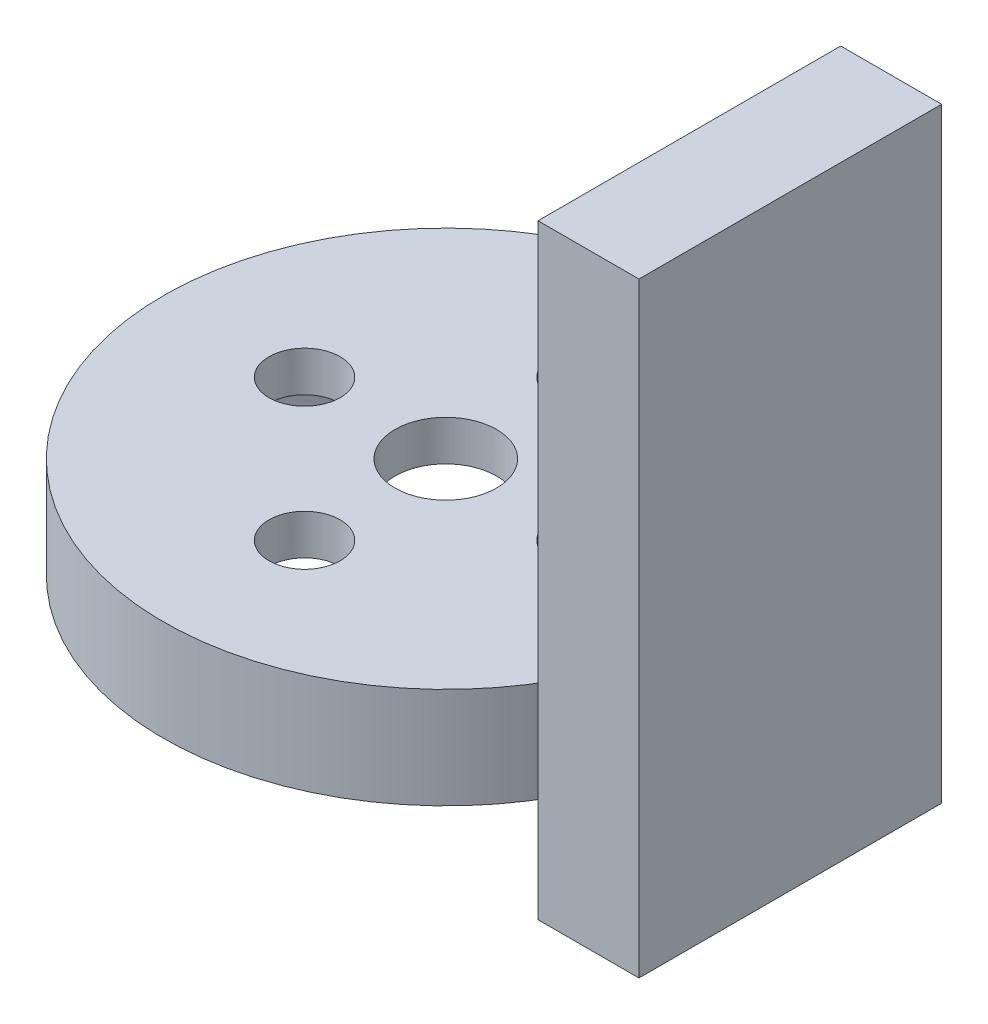
ISO-10303-21;
HEADER;
FILE_DESCRIPTION(('STEP AP214'),'2;1');
FILE_NAME('part.step','',(''),(''),'','','');
FILE_SCHEMA(('AUTOMOTIVE_DESIGN { 1 0 10303 214 1 1 1 1 }'));
ENDSEC;
DATA;
#1=APPLICATION_CONTEXT('core data for automotive mechanical design processes');
#2=APPLICATION_PROTOCOL_DEFINITION('international standard','automotive_design',2000,#1);
#3=PRODUCT_CONTEXT('',#1,'mechanical');
#4=PRODUCT('Part','Part','',(#3));
#5=PRODUCT_RELATED_PRODUCT_CATEGORY('part','',(#4));
#6=PRODUCT_DEFINITION_FORMATION('','',#4);
#7=PRODUCT_DEFINITION_CONTEXT('part definition',#1,'design');
#8=PRODUCT_DEFINITION('design','',#6,#7);
#9=PRODUCT_DEFINITION_SHAPE('','',#8);
#10=(LENGTH_UNIT() NAMED_UNIT(*) SI_UNIT(.MILLI.,.METRE.));
#11=(NAMED_UNIT(*) PLANE_ANGLE_UNIT() SI_UNIT($,.RADIAN.));
#12=(NAMED_UNIT(*) SI_UNIT($,.STERADIAN.) SOLID_ANGLE_UNIT());
#13=UNCERTAINTY_MEASURE_WITH_UNIT(LENGTH_MEASURE(1.E-05),#10,'distance_accuracy_value','');
#14=(GEOMETRIC_REPRESENTATION_CONTEXT(3) GLOBAL_UNCERTAINTY_ASSIGNED_CONTEXT((#13)) GLOBAL_UNIT_ASSIGNED_CONTEXT((#10,
#11,#12)) REPRESENTATION_CONTEXT('',''));
#15=CARTESIAN_POINT('',(0.,0.,0.));
#16=DIRECTION('',(0.,0.,1.));
#17=DIRECTION('',(1.,0.,0.));
#18=AXIS2_PLACEMENT_3D('',#15,#16,#17);
#19=CARTESIAN_POINT('',(0.,5.,0.));
#20=DIRECTION('',(0.,-1.,0.));
#21=DIRECTION('',(0.,0.,-1.));
#22=AXIS2_PLACEMENT_3D('',#19,#20,#21);
#23=CYLINDRICAL_SURFACE('',#22,2.51726059342607);
#24=CARTESIAN_POINT('',(0.,5.,0.));
#25=DIRECTION('',(0.,1.,0.));
#26=DIRECTION('',(0.,0.,1.));
#27=AXIS2_PLACEMENT_3D('',#24,#25,#26);
#28=CIRCLE('',#27,2.51726059342607);
#29=CARTESIAN_POINT('',(0.,5.,2.51726059342607));
#30=VERTEX_POINT('',#29);
#31=EDGE_CURVE('E166',#30,#30,#28,.T.);
#32=ORIENTED_EDGE('',*,*,#31,.T.);
#33=EDGE_LOOP('',(#32));
#34=FACE_BOUND('',#33,.T.);
#35=CARTESIAN_POINT('',(0.,3.,0.));
#36=DIRECTION('',(0.,-1.,0.));
#37=DIRECTION('',(0.,0.,-1.));
#38=AXIS2_PLACEMENT_3D('',#35,#36,#37);
#39=CIRCLE('',#38,2.51726059342607);
#40=CARTESIAN_POINT('',(0.,3.,-2.51726059342607));
#41=VERTEX_POINT('',#40);
#42=EDGE_CURVE('E132',#41,#41,#39,.T.);
#43=ORIENTED_EDGE('',*,*,#42,.T.);
#44=EDGE_LOOP('',(#43));
#45=FACE_BOUND('',#44,.T.);
#46=ADVANCED_FACE('F33',(#34,#45),#23,.F.);
#47=CARTESIAN_POINT('',(0.,5.,-7.));
#48=DIRECTION('',(0.,-1.,0.));
#49=DIRECTION('',(0.,0.,-1.));
#50=AXIS2_PLACEMENT_3D('',#47,#48,#49);
#51=CYLINDRICAL_SURFACE('',#50,1.76208241539825);
#52=CARTESIAN_POINT('',(0.,5.,-7.));
#53=DIRECTION('',(0.,1.,0.));
#54=DIRECTION('',(0.,0.,1.));
#55=AXIS2_PLACEMENT_3D('',#52,#53,#54);
#56=CIRCLE('',#55,1.76208241539825);
#57=CARTESIAN_POINT('',(0.,5.,-5.23791758460175));
#58=VERTEX_POINT('',#57);
#59=EDGE_CURVE('E163',#58,#58,#56,.T.);
#60=ORIENTED_EDGE('',*,*,#59,.T.);
#61=EDGE_LOOP('',(#60));
#62=FACE_BOUND('',#61,.T.);
#63=CARTESIAN_POINT('',(0.,3.,-7.));
#64=DIRECTION('',(0.,-1.,0.));
#65=DIRECTION('',(0.,0.,-1.));
#66=AXIS2_PLACEMENT_3D('',#63,#64,#65);
#67=CIRCLE('',#66,1.76208241539825);
#68=CARTESIAN_POINT('',(0.,3.,-8.76208241539825));
#69=VERTEX_POINT('',#68);
#70=EDGE_CURVE('E290',#69,#69,#67,.T.);
#71=ORIENTED_EDGE('',*,*,#70,.T.);
#72=EDGE_LOOP('',(#71));
#73=FACE_BOUND('',#72,.T.);
#74=ADVANCED_FACE('F228',(#62,#73),#51,.F.);
#75=CARTESIAN_POINT('',(7.0000000000002,5.,-1.98094713253425E-13));
#76=DIRECTION('',(0.,-1.,0.));
#77=DIRECTION('',(0.,0.,-1.));
#78=AXIS2_PLACEMENT_3D('',#75,#76,#77);
#79=CYLINDRICAL_SURFACE('',#78,1.7620824153984);
#80=CARTESIAN_POINT('',(7.0000000000002,5.,-1.98094713253425E-13));
#81=DIRECTION('',(0.,1.,0.));
#82=DIRECTION('',(0.,0.,1.));
#83=AXIS2_PLACEMENT_3D('',#80,#81,#82);
#84=CIRCLE('',#83,1.7620824153984);
#85=CARTESIAN_POINT('',(7.0000000000002,5.,1.7620824153982));
#86=VERTEX_POINT('',#85);
#87=EDGE_CURVE('E160',#86,#86,#84,.T.);
#88=ORIENTED_EDGE('',*,*,#87,.T.);
#89=EDGE_LOOP('',(#88));
#90=FACE_BOUND('',#89,.T.);
#91=CARTESIAN_POINT('',(7.0000000000002,3.,-1.98094713253425E-13));
#92=DIRECTION('',(0.,-1.,0.));
#93=DIRECTION('',(0.,0.,-1.));
#94=AXIS2_PLACEMENT_3D('',#91,#92,#93);
#95=CIRCLE('',#94,1.7620824153984);
#96=CARTESIAN_POINT('',(7.0000000000002,3.,-1.7620824153986));
#97=VERTEX_POINT('',#96);
#98=EDGE_CURVE('E288',#97,#97,#95,.T.);
#99=ORIENTED_EDGE('',*,*,#98,.T.);
#100=EDGE_LOOP('',(#99));
#101=FACE_BOUND('',#100,.T.);
#102=ADVANCED_FACE('F234',(#90,#101),#79,.F.);
#103=CARTESIAN_POINT('',(3.9618942650685E-13,5.,7.));
#104=DIRECTION('',(0.,-1.,0.));
#105=DIRECTION('',(0.,0.,-1.));
#106=AXIS2_PLACEMENT_3D('',#103,#104,#105);
#107=CYLINDRICAL_SURFACE('',#106,1.76208241539867);
#108=CARTESIAN_POINT('',(3.9618942650685E-13,5.,7.));
#109=DIRECTION('',(0.,1.,0.));
#110=DIRECTION('',(0.,0.,1.));
#111=AXIS2_PLACEMENT_3D('',#108,#109,#110);
#112=CIRCLE('',#111,1.76208241539867);
#113=CARTESIAN_POINT('',(3.9618942650685E-13,5.,8.76208241539867));
#114=VERTEX_POINT('',#113);
#115=EDGE_CURVE('E157',#114,#114,#112,.T.);
#116=ORIENTED_EDGE('',*,*,#115,.T.);
#117=EDGE_LOOP('',(#116));
#118=FACE_BOUND('',#117,.T.);
#119=CARTESIAN_POINT('',(3.9618942650685E-13,3.,7.));
#120=DIRECTION('',(0.,-1.,0.));
#121=DIRECTION('',(0.,0.,-1.));
#122=AXIS2_PLACEMENT_3D('',#119,#120,#121);
#123=CIRCLE('',#122,1.76208241539867);
#124=CARTESIAN_POINT('',(3.9618942650685E-13,3.,5.23791758460133));
#125=VERTEX_POINT('',#124);
#126=EDGE_CURVE('E178',#125,#125,#123,.T.);
#127=ORIENTED_EDGE('',*,*,#126,.T.);
#128=EDGE_LOOP('',(#127));
#129=FACE_BOUND('',#128,.T.);
#130=ADVANCED_FACE('F276',(#118,#129),#107,.F.);
#131=CARTESIAN_POINT('',(-6.9999999999998,5.,1.98951966012828E-13));
#132=DIRECTION('',(0.,-1.,0.));
#133=DIRECTION('',(0.,0.,-1.));
#134=AXIS2_PLACEMENT_3D('',#131,#132,#133);
#135=CYLINDRICAL_SURFACE('',#134,1.76208241539857);
#136=CARTESIAN_POINT('',(-6.9999999999998,5.,1.98951966012828E-13));
#137=DIRECTION('',(0.,1.,0.));
#138=DIRECTION('',(0.,0.,1.));
#139=AXIS2_PLACEMENT_3D('',#136,#137,#138);
#140=CIRCLE('',#139,1.76208241539857);
#141=CARTESIAN_POINT('',(-6.9999999999998,5.,1.76208241539876));
#142=VERTEX_POINT('',#141);
#143=EDGE_CURVE('E154',#142,#142,#140,.T.);
#144=ORIENTED_EDGE('',*,*,#143,.T.);
#145=EDGE_LOOP('',(#144));
#146=FACE_BOUND('',#145,.T.);
#147=CARTESIAN_POINT('',(-6.9999999999998,3.,1.98951966012828E-13));
#148=DIRECTION('',(0.,-1.,0.));
#149=DIRECTION('',(0.,0.,-1.));
#150=AXIS2_PLACEMENT_3D('',#147,#148,#149);
#151=CIRCLE('',#150,1.76208241539857);
#152=CARTESIAN_POINT('',(-6.9999999999998,3.,-1.76208241539837));
#153=VERTEX_POINT('',#152);
#154=EDGE_CURVE('E175',#153,#153,#151,.T.);
#155=ORIENTED_EDGE('',*,*,#154,.T.);
#156=EDGE_LOOP('',(#155));
#157=FACE_BOUND('',#156,.T.);
#158=ADVANCED_FACE('F242',(#146,#157),#135,.F.);
#159=CARTESIAN_POINT('',(0.,5.,0.));
#160=DIRECTION('',(0.,1.,0.));
#161=DIRECTION('',(0.,0.,1.));
#162=AXIS2_PLACEMENT_3D('',#159,#160,#161);
#163=PLANE('',#162);
#164=DIRECTION('',(0.,0.,1.));
#165=VECTOR('',#164,1.);
#166=CARTESIAN_POINT('',(17.0714946528496,5.,0.));
#167=LINE('',#166,#165);
#168=CARTESIAN_POINT('',(17.0714946528496,5.,-2.5));
#169=VERTEX_POINT('',#168);
#170=CARTESIAN_POINT('',(17.0714946528496,5.,7.2008666034371));
#171=VERTEX_POINT('',#170);
#172=EDGE_CURVE('E141',#169,#171,#167,.T.);
#173=ORIENTED_EDGE('',*,*,#172,.F.);
#174=DIRECTION('',(-1.,0.,0.));
#175=VECTOR('',#174,1.);
#176=CARTESIAN_POINT('',(22.0714946528496,5.,-2.5));
#177=LINE('',#176,#175);
#178=CARTESIAN_POINT('',(14.5859521458148,5.,-2.5));
#179=VERTEX_POINT('',#178);
#180=EDGE_CURVE('E145',#169,#179,#177,.T.);
#181=ORIENTED_EDGE('',*,*,#180,.T.);
#182=CARTESIAN_POINT('',(14.5859521458148,5.,-3.5));
#183=DIRECTION('',(0.,1.,0.));
#184=DIRECTION('',(0.,0.,1.));
#185=AXIS2_PLACEMENT_3D('',#182,#183,#184);
#186=CIRCLE('',#185,1.);
#187=CARTESIAN_POINT('',(13.6135553360938,5.,-3.26666666666667));
#188=VERTEX_POINT('',#187);
#189=EDGE_CURVE('E197',#179,#188,#186,.F.);
#190=ORIENTED_EDGE('',*,*,#189,.T.);
#191=CARTESIAN_POINT('',(0.,5.,0.));
#192=DIRECTION('',(0.,1.,0.));
#193=DIRECTION('',(0.,0.,1.));
#194=AXIS2_PLACEMENT_3D('',#191,#192,#193);
#195=CIRCLE('',#194,14.);
#196=CARTESIAN_POINT('',(13.4951999670247,5.,3.72553054611239));
#197=VERTEX_POINT('',#196);
#198=EDGE_CURVE('E170',#188,#197,#195,.T.);
#199=ORIENTED_EDGE('',*,*,#198,.T.);
#200=CARTESIAN_POINT('',(14.4591428218122,5.,3.9916398708347));
#201=DIRECTION('',(0.,1.,0.));
#202=DIRECTION('',(0.,0.,1.));
#203=AXIS2_PLACEMENT_3D('',#200,#201,#202);
#204=CIRCLE('',#203,1.);
#205=CARTESIAN_POINT('',(15.0560548640528,5.,3.18933318768411));
#206=VERTEX_POINT('',#205);
#207=EDGE_CURVE('E41',#197,#206,#204,.F.);
#208=ORIENTED_EDGE('',*,*,#207,.T.);
#209=CARTESIAN_POINT('',(12.0714946528496,5.,7.2008666034371));
#210=DIRECTION('',(0.,1.,0.));
#211=DIRECTION('',(0.,0.,1.));
#212=AXIS2_PLACEMENT_3D('',#209,#210,#211);
#213=CIRCLE('',#212,5.);
#214=EDGE_CURVE('E184',#206,#171,#213,.F.);
#215=ORIENTED_EDGE('',*,*,#214,.T.);
#216=EDGE_LOOP('',(#173,#181,#190,#199,#208,#215));
#217=FACE_BOUND('',#216,.T.);
#218=ORIENTED_EDGE('',*,*,#115,.F.);
#219=EDGE_LOOP('',(#218));
#220=FACE_BOUND('',#219,.T.);
#221=ORIENTED_EDGE('',*,*,#59,.F.);
#222=EDGE_LOOP('',(#221));
#223=FACE_BOUND('',#222,.T.);
#224=ORIENTED_EDGE('',*,*,#31,.F.);
#225=EDGE_LOOP('',(#224));
#226=FACE_BOUND('',#225,.T.);
#227=ORIENTED_EDGE('',*,*,#87,.F.);
#228=EDGE_LOOP('',(#227));
#229=FACE_BOUND('',#228,.T.);
#230=ORIENTED_EDGE('',*,*,#143,.F.);
#231=EDGE_LOOP('',(#230));
#232=FACE_BOUND('',#231,.T.);
#233=ADVANCED_FACE('F200',(#217,#220,#223,#226,#229,#232),#163,.T.);
#234=CARTESIAN_POINT('',(0.,0.,0.));
#235=DIRECTION('',(0.,1.,0.));
#236=DIRECTION('',(0.,0.,1.));
#237=AXIS2_PLACEMENT_3D('',#234,#235,#236);
#238=PLANE('',#237);
#239=CARTESIAN_POINT('',(0.,0.,0.));
#240=DIRECTION('',(0.,-1.,0.));
#241=DIRECTION('',(0.,0.,-1.));
#242=AXIS2_PLACEMENT_3D('',#239,#240,#241);
#243=CIRCLE('',#242,10.75);
#244=CARTESIAN_POINT('',(0.,0.,-10.75));
#245=VERTEX_POINT('',#244);
#246=EDGE_CURVE('E296',#245,#245,#243,.T.);
#247=ORIENTED_EDGE('',*,*,#246,.F.);
#248=EDGE_LOOP('',(#247));
#249=FACE_BOUND('',#248,.T.);
#250=CARTESIAN_POINT('',(0.,0.,0.));
#251=DIRECTION('',(0.,1.,0.));
#252=DIRECTION('',(0.,0.,1.));
#253=AXIS2_PLACEMENT_3D('',#250,#251,#252);
#254=CIRCLE('',#253,14.);
#255=CARTESIAN_POINT('',(13.6135553360938,0.,-3.26666666666667));
#256=VERTEX_POINT('',#255);
#257=CARTESIAN_POINT('',(13.4951999670247,0.,3.72553054611239));
#258=VERTEX_POINT('',#257);
#259=EDGE_CURVE('E169',#256,#258,#254,.T.);
#260=ORIENTED_EDGE('',*,*,#259,.F.);
#261=CARTESIAN_POINT('',(14.5859521458148,0.,-3.5));
#262=DIRECTION('',(0.,1.,0.));
#263=DIRECTION('',(0.,0.,1.));
#264=AXIS2_PLACEMENT_3D('',#261,#262,#263);
#265=CIRCLE('',#264,1.);
#266=CARTESIAN_POINT('',(14.5859521458148,0.,-2.5));
#267=VERTEX_POINT('',#266);
#268=EDGE_CURVE('E195',#256,#267,#265,.T.);
#269=ORIENTED_EDGE('',*,*,#268,.T.);
#270=DIRECTION('',(-1.,0.,0.));
#271=VECTOR('',#270,1.);
#272=CARTESIAN_POINT('',(22.0714946528496,0.,-2.5));
#273=LINE('',#272,#271);
#274=CARTESIAN_POINT('',(22.0714946528496,0.,-2.5));
#275=VERTEX_POINT('',#274);
#276=EDGE_CURVE('E148',#275,#267,#273,.T.);
#277=ORIENTED_EDGE('',*,*,#276,.F.);
#278=DIRECTION('',(0.,0.,-1.));
#279=VECTOR('',#278,1.);
#280=CARTESIAN_POINT('',(22.0714946528496,0.,2.5));
#281=LINE('',#280,#279);
#282=CARTESIAN_POINT('',(22.0714946528496,0.,12.5));
#283=VERTEX_POINT('',#282);
#284=EDGE_CURVE('E146',#283,#275,#281,.T.);
#285=ORIENTED_EDGE('',*,*,#284,.F.);
#286=DIRECTION('',(-1.,0.,0.));
#287=VECTOR('',#286,1.);
#288=CARTESIAN_POINT('',(22.0714946528496,0.,12.5));
#289=LINE('',#288,#287);
#290=CARTESIAN_POINT('',(17.0714946528496,0.,12.5));
#291=VERTEX_POINT('',#290);
#292=EDGE_CURVE('E108',#283,#291,#289,.T.);
#293=ORIENTED_EDGE('',*,*,#292,.T.);
#294=DIRECTION('',(0.,0.,-1.));
#295=VECTOR('',#294,1.);
#296=CARTESIAN_POINT('',(17.0714946528496,0.,-2.5));
#297=LINE('',#296,#295);
#298=CARTESIAN_POINT('',(17.0714946528496,0.,7.2008666034371));
#299=VERTEX_POINT('',#298);
#300=EDGE_CURVE('E127',#291,#299,#297,.T.);
#301=ORIENTED_EDGE('',*,*,#300,.T.);
#302=CARTESIAN_POINT('',(12.0714946528496,0.,7.2008666034371));
#303=DIRECTION('',(0.,1.,0.));
#304=DIRECTION('',(0.,0.,1.));
#305=AXIS2_PLACEMENT_3D('',#302,#303,#304);
#306=CIRCLE('',#305,5.);
#307=CARTESIAN_POINT('',(15.0560548640528,0.,3.18933318768411));
#308=VERTEX_POINT('',#307);
#309=EDGE_CURVE('E182',#299,#308,#306,.T.);
#310=ORIENTED_EDGE('',*,*,#309,.T.);
#311=CARTESIAN_POINT('',(14.4591428218122,0.,3.9916398708347));
#312=DIRECTION('',(0.,1.,0.));
#313=DIRECTION('',(0.,0.,1.));
#314=AXIS2_PLACEMENT_3D('',#311,#312,#313);
#315=CIRCLE('',#314,1.);
#316=EDGE_CURVE('E11',#308,#258,#315,.T.);
#317=ORIENTED_EDGE('',*,*,#316,.T.);
#318=EDGE_LOOP('',(#260,#269,#277,#285,#293,#301,#310,#317));
#319=FACE_BOUND('',#318,.T.);
#320=ADVANCED_FACE('F213',(#249,#319),#238,.F.);
#321=CARTESIAN_POINT('',(0.,5.,0.));
#322=DIRECTION('',(0.,-1.,0.));
#323=DIRECTION('',(0.,0.,-1.));
#324=AXIS2_PLACEMENT_3D('',#321,#322,#323);
#325=CYLINDRICAL_SURFACE('',#324,14.);
#326=ORIENTED_EDGE('',*,*,#198,.F.);
#327=DIRECTION('',(0.,-1.,0.));
#328=VECTOR('',#327,1.);
#329=CARTESIAN_POINT('',(13.6135553360938,5.,-3.26666666666667));
#330=LINE('',#329,#328);
#331=EDGE_CURVE('E189',#188,#256,#330,.T.);
#332=ORIENTED_EDGE('',*,*,#331,.T.);
#333=ORIENTED_EDGE('',*,*,#259,.T.);
#334=DIRECTION('',(0.,-1.,0.));
#335=VECTOR('',#334,1.);
#336=CARTESIAN_POINT('',(13.4951999670247,5.,3.72553054611239));
#337=LINE('',#336,#335);
#338=EDGE_CURVE('E186',#258,#197,#337,.F.);
#339=ORIENTED_EDGE('',*,*,#338,.T.);
#340=EDGE_LOOP('',(#326,#332,#333,#339));
#341=FACE_BOUND('',#340,.T.);
#342=ADVANCED_FACE('F207',(#341),#325,.T.);
#343=CARTESIAN_POINT('',(22.0714946528496,0.,-2.5));
#344=DIRECTION('',(0.,0.,-1.));
#345=DIRECTION('',(-1.,0.,0.));
#346=AXIS2_PLACEMENT_3D('',#343,#344,#345);
#347=PLANE('',#346);
#348=ORIENTED_EDGE('',*,*,#276,.T.);
#349=DIRECTION('',(0.,-1.,0.));
#350=VECTOR('',#349,1.);
#351=CARTESIAN_POINT('',(14.5859521458148,0.,-2.5));
#352=LINE('',#351,#350);
#353=EDGE_CURVE('E192',#267,#179,#352,.F.);
#354=ORIENTED_EDGE('',*,*,#353,.T.);
#355=ORIENTED_EDGE('',*,*,#180,.F.);
#356=DIRECTION('',(0.,-1.,0.));
#357=VECTOR('',#356,1.);
#358=CARTESIAN_POINT('',(17.0714946528496,30.,-2.5));
#359=LINE('',#358,#357);
#360=CARTESIAN_POINT('',(17.0714946528496,30.,-2.5));
#361=VERTEX_POINT('',#360);
#362=EDGE_CURVE('E138',#361,#169,#359,.T.);
#363=ORIENTED_EDGE('',*,*,#362,.F.);
#364=DIRECTION('',(1.,0.,0.));
#365=VECTOR('',#364,1.);
#366=CARTESIAN_POINT('',(22.0714946528496,30.,-2.5));
#367=LINE('',#366,#365);
#368=CARTESIAN_POINT('',(22.0714946528496,30.,-2.5));
#369=VERTEX_POINT('',#368);
#370=EDGE_CURVE('E113',#361,#369,#367,.T.);
#371=ORIENTED_EDGE('',*,*,#370,.T.);
#372=DIRECTION('',(0.,1.,0.));
#373=VECTOR('',#372,1.);
#374=CARTESIAN_POINT('',(22.0714946528496,0.,-2.5));
#375=LINE('',#374,#373);
#376=EDGE_CURVE('E126',#275,#369,#375,.T.);
#377=ORIENTED_EDGE('',*,*,#376,.F.);
#378=EDGE_LOOP('',(#348,#354,#355,#363,#371,#377));
#379=FACE_BOUND('',#378,.T.);
#380=ADVANCED_FACE('F215',(#379),#347,.T.);
#381=CARTESIAN_POINT('',(22.0714946528496,0.,2.5));
#382=DIRECTION('',(1.,0.,0.));
#383=DIRECTION('',(0.,0.,-1.));
#384=AXIS2_PLACEMENT_3D('',#381,#382,#383);
#385=PLANE('',#384);
#386=ORIENTED_EDGE('',*,*,#376,.T.);
#387=DIRECTION('',(0.,0.,1.));
#388=VECTOR('',#387,1.);
#389=CARTESIAN_POINT('',(22.0714946528496,30.,-2.5));
#390=LINE('',#389,#388);
#391=CARTESIAN_POINT('',(22.0714946528496,30.,12.5));
#392=VERTEX_POINT('',#391);
#393=EDGE_CURVE('E120',#369,#392,#390,.T.);
#394=ORIENTED_EDGE('',*,*,#393,.T.);
#395=DIRECTION('',(0.,-1.,0.));
#396=VECTOR('',#395,1.);
#397=CARTESIAN_POINT('',(22.0714946528496,30.,12.5));
#398=LINE('',#397,#396);
#399=EDGE_CURVE('E103',#392,#283,#398,.T.);
#400=ORIENTED_EDGE('',*,*,#399,.T.);
#401=ORIENTED_EDGE('',*,*,#284,.T.);
#402=EDGE_LOOP('',(#386,#394,#400,#401));
#403=FACE_BOUND('',#402,.T.);
#404=ADVANCED_FACE('F125',(#403),#385,.T.);
#405=CARTESIAN_POINT('',(17.0714946528496,30.,-2.5));
#406=DIRECTION('',(-1.,0.,0.));
#407=DIRECTION('',(0.,0.,1.));
#408=AXIS2_PLACEMENT_3D('',#405,#406,#407);
#409=PLANE('',#408);
#410=ORIENTED_EDGE('',*,*,#172,.T.);
#411=DIRECTION('',(0.,1.,0.));
#412=VECTOR('',#411,1.);
#413=CARTESIAN_POINT('',(17.0714946528496,0.,7.2008666034371));
#414=LINE('',#413,#412);
#415=EDGE_CURVE('E172',#171,#299,#414,.F.);
#416=ORIENTED_EDGE('',*,*,#415,.T.);
#417=ORIENTED_EDGE('',*,*,#300,.F.);
#418=DIRECTION('',(0.,-1.,0.));
#419=VECTOR('',#418,1.);
#420=CARTESIAN_POINT('',(17.0714946528496,30.,12.5));
#421=LINE('',#420,#419);
#422=CARTESIAN_POINT('',(17.0714946528496,30.,12.5));
#423=VERTEX_POINT('',#422);
#424=EDGE_CURVE('E112',#423,#291,#421,.T.);
#425=ORIENTED_EDGE('',*,*,#424,.F.);
#426=DIRECTION('',(0.,0.,-1.));
#427=VECTOR('',#426,1.);
#428=CARTESIAN_POINT('',(17.0714946528496,30.,-2.5));
#429=LINE('',#428,#427);
#430=EDGE_CURVE('E123',#423,#361,#429,.T.);
#431=ORIENTED_EDGE('',*,*,#430,.T.);
#432=ORIENTED_EDGE('',*,*,#362,.T.);
#433=EDGE_LOOP('',(#410,#416,#417,#425,#431,#432));
#434=FACE_BOUND('',#433,.T.);
#435=ADVANCED_FACE('F219',(#434),#409,.T.);
#436=CARTESIAN_POINT('',(22.0714946528496,30.,12.5));
#437=DIRECTION('',(0.,0.,1.));
#438=DIRECTION('',(1.,0.,0.));
#439=AXIS2_PLACEMENT_3D('',#436,#437,#438);
#440=PLANE('',#439);
#441=ORIENTED_EDGE('',*,*,#292,.F.);
#442=ORIENTED_EDGE('',*,*,#399,.F.);
#443=DIRECTION('',(-1.,0.,0.));
#444=VECTOR('',#443,1.);
#445=CARTESIAN_POINT('',(22.0714946528496,30.,12.5));
#446=LINE('',#445,#444);
#447=EDGE_CURVE('E106',#392,#423,#446,.T.);
#448=ORIENTED_EDGE('',*,*,#447,.T.);
#449=ORIENTED_EDGE('',*,*,#424,.T.);
#450=EDGE_LOOP('',(#441,#442,#448,#449));
#451=FACE_BOUND('',#450,.T.);
#452=ADVANCED_FACE('F105',(#451),#440,.T.);
#453=CARTESIAN_POINT('',(0.,30.,0.));
#454=DIRECTION('',(0.,-1.,0.));
#455=DIRECTION('',(0.,0.,-1.));
#456=AXIS2_PLACEMENT_3D('',#453,#454,#455);
#457=PLANE('',#456);
#458=ORIENTED_EDGE('',*,*,#393,.F.);
#459=ORIENTED_EDGE('',*,*,#370,.F.);
#460=ORIENTED_EDGE('',*,*,#430,.F.);
#461=ORIENTED_EDGE('',*,*,#447,.F.);
#462=EDGE_LOOP('',(#458,#459,#460,#461));
#463=FACE_BOUND('',#462,.T.);
#464=ADVANCED_FACE('F118',(#463),#457,.F.);
#465=CARTESIAN_POINT('',(0.,3.,0.));
#466=DIRECTION('',(0.,-1.,0.));
#467=DIRECTION('',(0.,0.,-1.));
#468=AXIS2_PLACEMENT_3D('',#465,#466,#467);
#469=CYLINDRICAL_SURFACE('',#468,10.75);
#470=CARTESIAN_POINT('',(0.,3.,0.));
#471=DIRECTION('',(0.,-1.,0.));
#472=DIRECTION('',(0.,0.,-1.));
#473=AXIS2_PLACEMENT_3D('',#470,#471,#472);
#474=CIRCLE('',#473,10.75);
#475=CARTESIAN_POINT('',(0.,3.,-10.75));
#476=VERTEX_POINT('',#475);
#477=EDGE_CURVE('E179',#476,#476,#474,.T.);
#478=ORIENTED_EDGE('',*,*,#477,.F.);
#479=EDGE_LOOP('',(#478));
#480=FACE_BOUND('',#479,.T.);
#481=ORIENTED_EDGE('',*,*,#246,.T.);
#482=EDGE_LOOP('',(#481));
#483=FACE_BOUND('',#482,.T.);
#484=ADVANCED_FACE('F253',(#480,#483),#469,.F.);
#485=CARTESIAN_POINT('',(0.,3.,0.));
#486=DIRECTION('',(0.,-1.,0.));
#487=DIRECTION('',(0.,0.,-1.));
#488=AXIS2_PLACEMENT_3D('',#485,#486,#487);
#489=PLANE('',#488);
#490=ORIENTED_EDGE('',*,*,#42,.F.);
#491=EDGE_LOOP('',(#490));
#492=FACE_BOUND('',#491,.T.);
#493=ORIENTED_EDGE('',*,*,#70,.F.);
#494=EDGE_LOOP('',(#493));
#495=FACE_BOUND('',#494,.T.);
#496=ORIENTED_EDGE('',*,*,#98,.F.);
#497=EDGE_LOOP('',(#496));
#498=FACE_BOUND('',#497,.T.);
#499=ORIENTED_EDGE('',*,*,#126,.F.);
#500=EDGE_LOOP('',(#499));
#501=FACE_BOUND('',#500,.T.);
#502=ORIENTED_EDGE('',*,*,#154,.F.);
#503=EDGE_LOOP('',(#502));
#504=FACE_BOUND('',#503,.T.);
#505=ORIENTED_EDGE('',*,*,#477,.T.);
#506=EDGE_LOOP('',(#505));
#507=FACE_BOUND('',#506,.T.);
#508=ADVANCED_FACE('F249',(#492,#495,#498,#501,#504,#507),#489,.T.);
#509=CARTESIAN_POINT('',(12.0714946528496,5.,7.2008666034371));
#510=DIRECTION('',(0.,-1.,0.));
#511=DIRECTION('',(0.,0.,-1.));
#512=AXIS2_PLACEMENT_3D('',#509,#510,#511);
#513=CYLINDRICAL_SURFACE('',#512,5.);
#514=ORIENTED_EDGE('',*,*,#214,.F.);
#515=DIRECTION('',(0.,-1.,0.));
#516=VECTOR('',#515,1.);
#517=CARTESIAN_POINT('',(15.0560548640528,5.,3.18933318768411));
#518=LINE('',#517,#516);
#519=EDGE_CURVE('E48',#206,#308,#518,.T.);
#520=ORIENTED_EDGE('',*,*,#519,.T.);
#521=ORIENTED_EDGE('',*,*,#309,.F.);
#522=ORIENTED_EDGE('',*,*,#415,.F.);
#523=EDGE_LOOP('',(#514,#520,#521,#522));
#524=FACE_BOUND('',#523,.T.);
#525=ADVANCED_FACE('F221',(#524),#513,.F.);
#526=CARTESIAN_POINT('',(14.5859521458148,5.,-3.5));
#527=DIRECTION('',(0.,-1.,0.));
#528=DIRECTION('',(0.,0.,-1.));
#529=AXIS2_PLACEMENT_3D('',#526,#527,#528);
#530=CYLINDRICAL_SURFACE('',#529,1.);
#531=ORIENTED_EDGE('',*,*,#189,.F.);
#532=ORIENTED_EDGE('',*,*,#353,.F.);
#533=ORIENTED_EDGE('',*,*,#268,.F.);
#534=ORIENTED_EDGE('',*,*,#331,.F.);
#535=EDGE_LOOP('',(#531,#532,#533,#534));
#536=FACE_BOUND('',#535,.T.);
#537=ADVANCED_FACE('F210',(#536),#530,.F.);
#538=CARTESIAN_POINT('',(14.4591428218122,5.,3.9916398708347));
#539=DIRECTION('',(0.,1.,0.));
#540=DIRECTION('',(0.,0.,1.));
#541=AXIS2_PLACEMENT_3D('',#538,#539,#540);
#542=CYLINDRICAL_SURFACE('',#541,1.);
#543=ORIENTED_EDGE('',*,*,#316,.F.);
#544=ORIENTED_EDGE('',*,*,#519,.F.);
#545=ORIENTED_EDGE('',*,*,#207,.F.);
#546=ORIENTED_EDGE('',*,*,#338,.F.);
#547=EDGE_LOOP('',(#543,#544,#545,#546));
#548=FACE_BOUND('',#547,.T.);
#549=ADVANCED_FACE('F35',(#548),#542,.F.);
#550=CLOSED_SHELL('',(#46,#74,#102,#130,#158,#233,#320,#342,#380,#404,#435,#452,#464,#484,#508,
#525,#537,#549));
#551=MANIFOLD_SOLID_BREP('B2',#550);
#552=ADVANCED_BREP_SHAPE_REPRESENTATION('',(#18,#551),#14);
#553=SHAPE_DEFINITION_REPRESENTATION(#9,#552);
ENDSEC;
END-ISO-10303-21;
